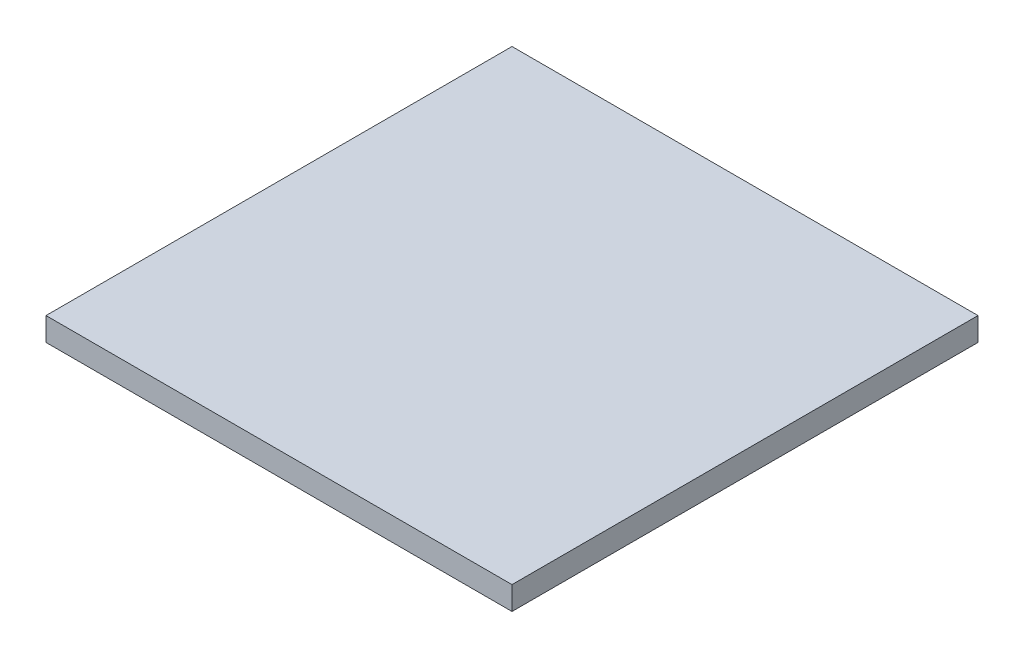
ISO-10303-21;
HEADER;
FILE_DESCRIPTION(('STEP AP214'),'2;1');
FILE_NAME('part.step','',(''),(''),'','','');
FILE_SCHEMA(('AUTOMOTIVE_DESIGN { 1 0 10303 214 1 1 1 1 }'));
ENDSEC;
DATA;
#1=APPLICATION_CONTEXT('core data for automotive mechanical design processes');
#2=APPLICATION_PROTOCOL_DEFINITION('international standard','automotive_design',2000,#1);
#3=PRODUCT_CONTEXT('',#1,'mechanical');
#4=PRODUCT('Part','Part','',(#3));
#5=PRODUCT_RELATED_PRODUCT_CATEGORY('part','',(#4));
#6=PRODUCT_DEFINITION_FORMATION('','',#4);
#7=PRODUCT_DEFINITION_CONTEXT('part definition',#1,'design');
#8=PRODUCT_DEFINITION('design','',#6,#7);
#9=PRODUCT_DEFINITION_SHAPE('','',#8);
#10=(LENGTH_UNIT() NAMED_UNIT(*) SI_UNIT(.MILLI.,.METRE.));
#11=(NAMED_UNIT(*) PLANE_ANGLE_UNIT() SI_UNIT($,.RADIAN.));
#12=(NAMED_UNIT(*) SI_UNIT($,.STERADIAN.) SOLID_ANGLE_UNIT());
#13=UNCERTAINTY_MEASURE_WITH_UNIT(LENGTH_MEASURE(1.E-05),#10,'distance_accuracy_value','');
#14=(GEOMETRIC_REPRESENTATION_CONTEXT(3) GLOBAL_UNCERTAINTY_ASSIGNED_CONTEXT((#13)) GLOBAL_UNIT_ASSIGNED_CONTEXT((#10,
#11,#12)) REPRESENTATION_CONTEXT('',''));
#15=CARTESIAN_POINT('',(0.,0.,0.));
#16=DIRECTION('',(0.,0.,1.));
#17=DIRECTION('',(1.,0.,0.));
#18=AXIS2_PLACEMENT_3D('',#15,#16,#17);
#19=CARTESIAN_POINT('',(-104.498269896194,10.,-61.2456747404844));
#20=DIRECTION('',(1.,0.,0.));
#21=DIRECTION('',(0.,0.,-1.));
#22=AXIS2_PLACEMENT_3D('',#19,#20,#21);
#23=PLANE('',#22);
#24=DIRECTION('',(0.,0.,1.));
#25=VECTOR('',#24,1.);
#26=CARTESIAN_POINT('',(-104.498269896194,0.,-61.2456747404844));
#27=LINE('',#26,#25);
#28=CARTESIAN_POINT('',(-104.498269896194,0.,-61.2456747404844));
#29=VERTEX_POINT('',#28);
#30=CARTESIAN_POINT('',(-104.498269896194,0.,138.754325259516));
#31=VERTEX_POINT('',#30);
#32=EDGE_CURVE('E96',#29,#31,#27,.T.);
#33=ORIENTED_EDGE('',*,*,#32,.T.);
#34=DIRECTION('',(0.,-1.,0.));
#35=VECTOR('',#34,1.);
#36=CARTESIAN_POINT('',(-104.498269896194,10.,138.754325259516));
#37=LINE('',#36,#35);
#38=CARTESIAN_POINT('',(-104.498269896194,10.,138.754325259516));
#39=VERTEX_POINT('',#38);
#40=EDGE_CURVE('E11',#39,#31,#37,.T.);
#41=ORIENTED_EDGE('',*,*,#40,.F.);
#42=DIRECTION('',(0.,0.,1.));
#43=VECTOR('',#42,1.);
#44=CARTESIAN_POINT('',(-104.498269896194,10.,-61.2456747404844));
#45=LINE('',#44,#43);
#46=CARTESIAN_POINT('',(-104.498269896194,10.,-61.2456747404844));
#47=VERTEX_POINT('',#46);
#48=EDGE_CURVE('E84',#47,#39,#45,.T.);
#49=ORIENTED_EDGE('',*,*,#48,.F.);
#50=DIRECTION('',(0.,-1.,0.));
#51=VECTOR('',#50,1.);
#52=CARTESIAN_POINT('',(-104.498269896194,10.,-61.2456747404844));
#53=LINE('',#52,#51);
#54=EDGE_CURVE('E92',#47,#29,#53,.T.);
#55=ORIENTED_EDGE('',*,*,#54,.T.);
#56=EDGE_LOOP('',(#33,#41,#49,#55));
#57=FACE_BOUND('',#56,.T.);
#58=ADVANCED_FACE('F33',(#57),#23,.F.);
#59=CARTESIAN_POINT('',(-104.498269896194,10.,138.754325259516));
#60=DIRECTION('',(0.,0.,-1.));
#61=DIRECTION('',(-1.,0.,0.));
#62=AXIS2_PLACEMENT_3D('',#59,#60,#61);
#63=PLANE('',#62);
#64=DIRECTION('',(1.,0.,0.));
#65=VECTOR('',#64,1.);
#66=CARTESIAN_POINT('',(-104.498269896194,0.,138.754325259516));
#67=LINE('',#66,#65);
#68=CARTESIAN_POINT('',(95.5017301038063,0.,138.754325259516));
#69=VERTEX_POINT('',#68);
#70=EDGE_CURVE('E88',#31,#69,#67,.T.);
#71=ORIENTED_EDGE('',*,*,#70,.T.);
#72=DIRECTION('',(0.,-1.,0.));
#73=VECTOR('',#72,1.);
#74=CARTESIAN_POINT('',(95.5017301038063,10.,138.754325259516));
#75=LINE('',#74,#73);
#76=CARTESIAN_POINT('',(95.5017301038063,10.,138.754325259516));
#77=VERTEX_POINT('',#76);
#78=EDGE_CURVE('E41',#77,#69,#75,.T.);
#79=ORIENTED_EDGE('',*,*,#78,.F.);
#80=DIRECTION('',(1.,0.,0.));
#81=VECTOR('',#80,1.);
#82=CARTESIAN_POINT('',(-104.498269896194,10.,138.754325259516));
#83=LINE('',#82,#81);
#84=EDGE_CURVE('E79',#39,#77,#83,.T.);
#85=ORIENTED_EDGE('',*,*,#84,.F.);
#86=ORIENTED_EDGE('',*,*,#40,.T.);
#87=EDGE_LOOP('',(#71,#79,#85,#86));
#88=FACE_BOUND('',#87,.T.);
#89=ADVANCED_FACE('F87',(#88),#63,.F.);
#90=CARTESIAN_POINT('',(95.5017301038062,10.,-61.2456747404844));
#91=DIRECTION('',(-1.,0.,0.));
#92=DIRECTION('',(0.,0.,1.));
#93=AXIS2_PLACEMENT_3D('',#90,#91,#92);
#94=PLANE('',#93);
#95=DIRECTION('',(0.,0.,-1.));
#96=VECTOR('',#95,1.);
#97=CARTESIAN_POINT('',(95.5017301038062,0.,-61.2456747404844));
#98=LINE('',#97,#96);
#99=CARTESIAN_POINT('',(95.5017301038062,0.,-61.2456747404844));
#100=VERTEX_POINT('',#99);
#101=EDGE_CURVE('E66',#69,#100,#98,.T.);
#102=ORIENTED_EDGE('',*,*,#101,.T.);
#103=DIRECTION('',(0.,-1.,0.));
#104=VECTOR('',#103,1.);
#105=CARTESIAN_POINT('',(95.5017301038062,10.,-61.2456747404844));
#106=LINE('',#105,#104);
#107=CARTESIAN_POINT('',(95.5017301038062,10.,-61.2456747404844));
#108=VERTEX_POINT('',#107);
#109=EDGE_CURVE('E89',#108,#100,#106,.T.);
#110=ORIENTED_EDGE('',*,*,#109,.F.);
#111=DIRECTION('',(0.,0.,-1.));
#112=VECTOR('',#111,1.);
#113=CARTESIAN_POINT('',(95.5017301038062,10.,-61.2456747404844));
#114=LINE('',#113,#112);
#115=EDGE_CURVE('E82',#77,#108,#114,.T.);
#116=ORIENTED_EDGE('',*,*,#115,.F.);
#117=ORIENTED_EDGE('',*,*,#78,.T.);
#118=EDGE_LOOP('',(#102,#110,#116,#117));
#119=FACE_BOUND('',#118,.T.);
#120=ADVANCED_FACE('F90',(#119),#94,.F.);
#121=CARTESIAN_POINT('',(-104.498269896194,10.,-61.2456747404844));
#122=DIRECTION('',(0.,0.,1.));
#123=DIRECTION('',(1.,0.,0.));
#124=AXIS2_PLACEMENT_3D('',#121,#122,#123);
#125=PLANE('',#124);
#126=DIRECTION('',(-1.,0.,0.));
#127=VECTOR('',#126,1.);
#128=CARTESIAN_POINT('',(-104.498269896194,0.,-61.2456747404844));
#129=LINE('',#128,#127);
#130=EDGE_CURVE('E72',#100,#29,#129,.T.);
#131=ORIENTED_EDGE('',*,*,#130,.T.);
#132=ORIENTED_EDGE('',*,*,#54,.F.);
#133=DIRECTION('',(-1.,0.,0.));
#134=VECTOR('',#133,1.);
#135=CARTESIAN_POINT('',(-104.498269896194,10.,-61.2456747404844));
#136=LINE('',#135,#134);
#137=EDGE_CURVE('E49',#108,#47,#136,.T.);
#138=ORIENTED_EDGE('',*,*,#137,.F.);
#139=ORIENTED_EDGE('',*,*,#109,.T.);
#140=EDGE_LOOP('',(#131,#132,#138,#139));
#141=FACE_BOUND('',#140,.T.);
#142=ADVANCED_FACE('F103',(#141),#125,.F.);
#143=CARTESIAN_POINT('',(0.,10.,0.));
#144=DIRECTION('',(0.,1.,0.));
#145=DIRECTION('',(0.,0.,1.));
#146=AXIS2_PLACEMENT_3D('',#143,#144,#145);
#147=PLANE('',#146);
#148=ORIENTED_EDGE('',*,*,#48,.T.);
#149=ORIENTED_EDGE('',*,*,#84,.T.);
#150=ORIENTED_EDGE('',*,*,#115,.T.);
#151=ORIENTED_EDGE('',*,*,#137,.T.);
#152=EDGE_LOOP('',(#148,#149,#150,#151));
#153=FACE_BOUND('',#152,.T.);
#154=ADVANCED_FACE('F80',(#153),#147,.T.);
#155=CARTESIAN_POINT('',(0.,0.,0.));
#156=DIRECTION('',(0.,1.,0.));
#157=DIRECTION('',(0.,0.,1.));
#158=AXIS2_PLACEMENT_3D('',#155,#156,#157);
#159=PLANE('',#158);
#160=ORIENTED_EDGE('',*,*,#32,.F.);
#161=ORIENTED_EDGE('',*,*,#130,.F.);
#162=ORIENTED_EDGE('',*,*,#101,.F.);
#163=ORIENTED_EDGE('',*,*,#70,.F.);
#164=EDGE_LOOP('',(#160,#161,#162,#163));
#165=FACE_BOUND('',#164,.T.);
#166=ADVANCED_FACE('F106',(#165),#159,.F.);
#167=CLOSED_SHELL('',(#58,#89,#120,#142,#154,#166));
#168=MANIFOLD_SOLID_BREP('B2',#167);
#169=ADVANCED_BREP_SHAPE_REPRESENTATION('',(#18,#168),#14);
#170=SHAPE_DEFINITION_REPRESENTATION(#9,#169);
ENDSEC;
END-ISO-10303-21;
